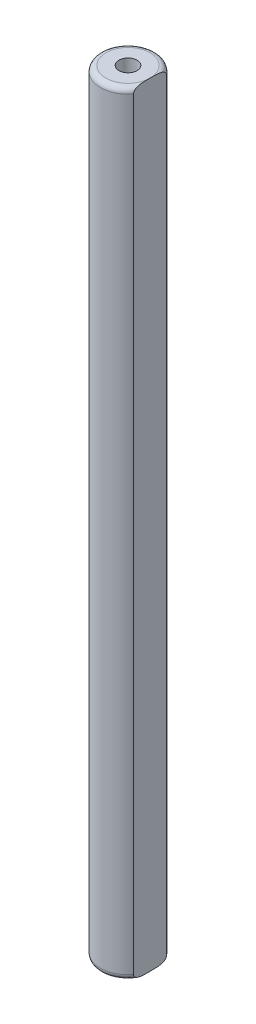
ISO-10303-21;
HEADER;
FILE_DESCRIPTION(('STEP AP214'),'2;1');
FILE_NAME('part.step','',(''),(''),'','','');
FILE_SCHEMA(('AUTOMOTIVE_DESIGN { 1 0 10303 214 1 1 1 1 }'));
ENDSEC;
DATA;
#1=APPLICATION_CONTEXT('core data for automotive mechanical design processes');
#2=APPLICATION_PROTOCOL_DEFINITION('international standard','automotive_design',2000,#1);
#3=PRODUCT_CONTEXT('',#1,'mechanical');
#4=PRODUCT('Part','Part','',(#3));
#5=PRODUCT_RELATED_PRODUCT_CATEGORY('part','',(#4));
#6=PRODUCT_DEFINITION_FORMATION('','',#4);
#7=PRODUCT_DEFINITION_CONTEXT('part definition',#1,'design');
#8=PRODUCT_DEFINITION('design','',#6,#7);
#9=PRODUCT_DEFINITION_SHAPE('','',#8);
#10=(LENGTH_UNIT() NAMED_UNIT(*) SI_UNIT(.MILLI.,.METRE.));
#11=(NAMED_UNIT(*) PLANE_ANGLE_UNIT() SI_UNIT($,.RADIAN.));
#12=(NAMED_UNIT(*) SI_UNIT($,.STERADIAN.) SOLID_ANGLE_UNIT());
#13=UNCERTAINTY_MEASURE_WITH_UNIT(LENGTH_MEASURE(1.E-05),#10,'distance_accuracy_value','');
#14=(GEOMETRIC_REPRESENTATION_CONTEXT(3) GLOBAL_UNCERTAINTY_ASSIGNED_CONTEXT((#13)) GLOBAL_UNIT_ASSIGNED_CONTEXT((#10,
#11,#12)) REPRESENTATION_CONTEXT('',''));
#15=CARTESIAN_POINT('',(0.,0.,0.));
#16=DIRECTION('',(0.,0.,1.));
#17=DIRECTION('',(1.,0.,0.));
#18=AXIS2_PLACEMENT_3D('',#15,#16,#17);
#19=CARTESIAN_POINT('',(0.,-35.15,0.));
#20=DIRECTION('',(0.,-1.,0.));
#21=DIRECTION('',(0.,0.,1.));
#22=AXIS2_PLACEMENT_3D('',#19,#20,#21);
#23=PLANE('',#22);
#24=CARTESIAN_POINT('',(0.,-35.15,0.));
#25=DIRECTION('',(0.,-1.,0.));
#26=DIRECTION('',(0.,0.,-1.));
#27=AXIS2_PLACEMENT_3D('',#24,#25,#26);
#28=CIRCLE('',#27,2.);
#29=CARTESIAN_POINT('',(2.,-35.15,0.));
#30=VERTEX_POINT('',#29);
#31=EDGE_CURVE('E11',#30,#30,#28,.T.);
#32=ORIENTED_EDGE('',*,*,#31,.T.);
#33=EDGE_LOOP('',(#32));
#34=FACE_BOUND('',#33,.T.);
#35=CARTESIAN_POINT('',(0.,-35.15,0.));
#36=DIRECTION('',(0.,1.,0.));
#37=DIRECTION('',(0.,0.,1.));
#38=AXIS2_PLACEMENT_3D('',#35,#36,#37);
#39=CIRCLE('',#38,0.825);
#40=CARTESIAN_POINT('',(0.,-35.15,0.825));
#41=VERTEX_POINT('',#40);
#42=EDGE_CURVE('E132',#41,#41,#39,.T.);
#43=ORIENTED_EDGE('',*,*,#42,.T.);
#44=EDGE_LOOP('',(#43));
#45=FACE_BOUND('',#44,.T.);
#46=ADVANCED_FACE('F32',(#34,#45),#23,.T.);
#47=CARTESIAN_POINT('',(0.,35.15,0.));
#48=DIRECTION('',(0.,-1.,0.));
#49=DIRECTION('',(0.,0.,-1.));
#50=AXIS2_PLACEMENT_3D('',#47,#48,#49);
#51=CYLINDRICAL_SURFACE('',#50,2.5);
#52=DIRECTION('',(0.,1.,0.));
#53=VECTOR('',#52,1.);
#54=CARTESIAN_POINT('',(2.,0.,-1.5));
#55=LINE('',#54,#53);
#56=CARTESIAN_POINT('',(2.,-34.65,-1.5));
#57=VERTEX_POINT('',#56);
#58=CARTESIAN_POINT('',(2.,34.65,-1.5));
#59=VERTEX_POINT('',#58);
#60=EDGE_CURVE('E79',#57,#59,#55,.T.);
#61=ORIENTED_EDGE('',*,*,#60,.F.);
#62=CARTESIAN_POINT('',(0.,-34.65,0.));
#63=DIRECTION('',(0.,-1.,0.));
#64=DIRECTION('',(0.,0.,-1.));
#65=AXIS2_PLACEMENT_3D('',#62,#63,#64);
#66=CIRCLE('',#65,2.5);
#67=CARTESIAN_POINT('',(2.,-34.65,1.5));
#68=VERTEX_POINT('',#67);
#69=EDGE_CURVE('E115',#57,#68,#66,.F.);
#70=ORIENTED_EDGE('',*,*,#69,.T.);
#71=DIRECTION('',(0.,1.,0.));
#72=VECTOR('',#71,1.);
#73=CARTESIAN_POINT('',(2.,0.,1.5));
#74=LINE('',#73,#72);
#75=CARTESIAN_POINT('',(2.,34.65,1.5));
#76=VERTEX_POINT('',#75);
#77=EDGE_CURVE('E120',#68,#76,#74,.T.);
#78=ORIENTED_EDGE('',*,*,#77,.T.);
#79=CARTESIAN_POINT('',(0.,34.65,0.));
#80=DIRECTION('',(0.,1.,0.));
#81=DIRECTION('',(0.,0.,1.));
#82=AXIS2_PLACEMENT_3D('',#79,#80,#81);
#83=CIRCLE('',#82,2.5);
#84=EDGE_CURVE('E74',#76,#59,#83,.F.);
#85=ORIENTED_EDGE('',*,*,#84,.T.);
#86=EDGE_LOOP('',(#61,#70,#78,#85));
#87=FACE_BOUND('',#86,.T.);
#88=ADVANCED_FACE('F151',(#87),#51,.T.);
#89=CARTESIAN_POINT('',(0.,35.15,0.));
#90=DIRECTION('',(0.,1.,0.));
#91=DIRECTION('',(0.,0.,1.));
#92=AXIS2_PLACEMENT_3D('',#89,#90,#91);
#93=PLANE('',#92);
#94=CARTESIAN_POINT('',(0.,35.15,0.));
#95=DIRECTION('',(0.,1.,0.));
#96=DIRECTION('',(0.,0.,1.));
#97=AXIS2_PLACEMENT_3D('',#94,#95,#96);
#98=CIRCLE('',#97,2.);
#99=CARTESIAN_POINT('',(2.,35.15,0.));
#100=VERTEX_POINT('',#99);
#101=EDGE_CURVE('E72',#100,#100,#98,.T.);
#102=ORIENTED_EDGE('',*,*,#101,.T.);
#103=EDGE_LOOP('',(#102));
#104=FACE_BOUND('',#103,.T.);
#105=CARTESIAN_POINT('',(0.,35.15,0.));
#106=DIRECTION('',(0.,1.,0.));
#107=DIRECTION('',(0.,0.,1.));
#108=AXIS2_PLACEMENT_3D('',#105,#106,#107);
#109=CIRCLE('',#108,0.825);
#110=CARTESIAN_POINT('',(0.,35.15,0.825));
#111=VERTEX_POINT('',#110);
#112=EDGE_CURVE('E87',#111,#111,#109,.T.);
#113=ORIENTED_EDGE('',*,*,#112,.F.);
#114=EDGE_LOOP('',(#113));
#115=FACE_BOUND('',#114,.T.);
#116=ADVANCED_FACE('F82',(#104,#115),#93,.T.);
#117=CARTESIAN_POINT('',(0.,30.15,0.));
#118=DIRECTION('',(0.,1.,0.));
#119=DIRECTION('',(0.,0.,1.));
#120=AXIS2_PLACEMENT_3D('',#117,#118,#119);
#121=CYLINDRICAL_SURFACE('',#120,0.825);
#122=CARTESIAN_POINT('',(0.,30.15,0.));
#123=DIRECTION('',(0.,1.,0.));
#124=DIRECTION('',(0.,0.,1.));
#125=AXIS2_PLACEMENT_3D('',#122,#123,#124);
#126=CIRCLE('',#125,0.825);
#127=CARTESIAN_POINT('',(0.,30.15,0.825));
#128=VERTEX_POINT('',#127);
#129=EDGE_CURVE('E84',#128,#128,#126,.T.);
#130=ORIENTED_EDGE('',*,*,#129,.F.);
#131=EDGE_LOOP('',(#130));
#132=FACE_BOUND('',#131,.T.);
#133=ORIENTED_EDGE('',*,*,#112,.T.);
#134=EDGE_LOOP('',(#133));
#135=FACE_BOUND('',#134,.T.);
#136=ADVANCED_FACE('F158',(#132,#135),#121,.F.);
#137=CARTESIAN_POINT('',(0.,30.15,0.));
#138=DIRECTION('',(0.,1.,0.));
#139=DIRECTION('',(0.,0.,1.));
#140=AXIS2_PLACEMENT_3D('',#137,#138,#139);
#141=PLANE('',#140);
#142=ORIENTED_EDGE('',*,*,#129,.T.);
#143=EDGE_LOOP('',(#142));
#144=FACE_BOUND('',#143,.T.);
#145=ADVANCED_FACE('F104',(#144),#141,.T.);
#146=CARTESIAN_POINT('',(2.,0.,-1.5));
#147=DIRECTION('',(-1.,0.,0.));
#148=DIRECTION('',(0.,0.,1.));
#149=AXIS2_PLACEMENT_3D('',#146,#147,#148);
#150=PLANE('',#149);
#151=ORIENTED_EDGE('',*,*,#77,.F.);
#152=CARTESIAN_POINT('',(2.,-34.65,1.5));
#153=CARTESIAN_POINT('',(2.,-34.6700065150284,1.50005508764519));
#154=CARTESIAN_POINT('',(2.,-34.6899505223803,1.49800297503596));
#155=CARTESIAN_POINT('',(2.,-34.7288908622129,1.49017103135305));
#156=CARTESIAN_POINT('',(2.,-34.747894786355,1.48442943896433));
#157=CARTESIAN_POINT('',(2.,-34.7845007170815,1.46971395516311));
#158=CARTESIAN_POINT('',(2.,-34.8021074472319,1.46075157527048));
#159=CARTESIAN_POINT('',(2.,-34.8357418270519,1.44018960181346));
#160=CARTESIAN_POINT('',(2.,-34.8517650844176,1.42858295243752));
#161=CARTESIAN_POINT('',(2.,-34.8889337995344,1.39760924057378));
#162=CARTESIAN_POINT('',(2.,-34.9091275913188,1.37710380043444));
#163=CARTESIAN_POINT('',(2.,-34.9460193785026,1.3332153788633));
#164=CARTESIAN_POINT('',(2.,-34.9627135559447,1.30982929844171));
#165=CARTESIAN_POINT('',(2.,-35.0025266059827,1.24588475655888));
#166=CARTESIAN_POINT('',(2.,-35.0231102761167,1.20375339504331));
#167=CARTESIAN_POINT('',(2.,-35.0492657628372,1.13857481760512));
#168=CARTESIAN_POINT('',(2.,-35.0572271665565,1.11639476146754));
#169=CARTESIAN_POINT('',(2.,-35.0717347834849,1.07158652733004));
#170=CARTESIAN_POINT('',(2.,-35.0782820228324,1.04895868735181));
#171=CARTESIAN_POINT('',(2.,-35.0954775535542,0.982989447767375));
#172=CARTESIAN_POINT('',(2.,-35.1045494991958,0.939240813702868));
#173=CARTESIAN_POINT('',(2.,-35.1194389319571,0.85118057519475));
#174=CARTESIAN_POINT('',(2.,-35.1252529100803,0.806868416119317));
#175=CARTESIAN_POINT('',(2.,-35.1345404183726,0.717748873858497));
#176=CARTESIAN_POINT('',(2.,-35.1380000262617,0.672940110398228));
#177=CARTESIAN_POINT('',(2.,-35.143276064899,0.583224127429996));
#178=CARTESIAN_POINT('',(2.,-35.1450920982067,0.53831688673903));
#179=CARTESIAN_POINT('',(2.,-35.1475884411658,0.45202717013826));
#180=CARTESIAN_POINT('',(2.,-35.148347176557,0.410646661478023));
#181=CARTESIAN_POINT('',(2.,-35.1493649293624,0.327877214900453));
#182=CARTESIAN_POINT('',(2.,-35.1496239046375,0.286488276566584));
#183=CARTESIAN_POINT('',(2.,-35.1499262759538,0.204245986253958));
#184=CARTESIAN_POINT('',(2.,-35.1499724201265,0.163392638975686));
#185=CARTESIAN_POINT('',(2.,-35.1499994454164,0.0816928216893292));
#186=CARTESIAN_POINT('',(2.,-35.1499803376138,0.0408463516913637));
#187=CARTESIAN_POINT('',(2.,-35.15,0.));
#188=B_SPLINE_CURVE_WITH_KNOTS('',3,(#152,#153,#154,#155,#156,#157,#158,#159,#160,#161,#162,
#163,#164,#165,#166,#167,#168,#169,#170,#171,#172,#173,#174,#175,#176,#177,#178,#179,#180,#181,
#182,#183,#184,#185,#186,#187),.UNSPECIFIED.,.F.,.F.,(4,2,2,2,2,2,2,2,2,2,2,2,2,2,2,2,2,4),(0.,
0.0598154823382477,0.119020807803606,0.178016596524454,0.237171689151979,0.323022405322567,
0.408966299732605,0.548800102010772,0.619474466309537,0.690097374684527,0.823948961414437,
0.957944437366601,1.09272554990601,1.22753924580541,1.35169671337948,1.47586464927862,
1.59842472260636,1.72096398530663),.UNSPECIFIED.);
#189=EDGE_CURVE('E41',#68,#30,#188,.T.);
#190=ORIENTED_EDGE('',*,*,#189,.T.);
#191=CARTESIAN_POINT('',(2.,-35.15,0.));
#192=CARTESIAN_POINT('',(2.,-35.149980484284,-0.0407626231076289));
#193=CARTESIAN_POINT('',(2.,-35.1499994433899,-0.0815253750922564));
#194=CARTESIAN_POINT('',(2.,-35.1499726519699,-0.163057529759021));
#195=CARTESIAN_POINT('',(2.,-35.1499268907924,-0.203826932431489));
#196=CARTESIAN_POINT('',(2.,-35.1496272394696,-0.285823216792328));
#197=CARTESIAN_POINT('',(2.,-35.1493710177251,-0.327050094241002));
#198=CARTESIAN_POINT('',(2.,-35.1483653267444,-0.409495794992682));
#199=CARTESIAN_POINT('',(2.,-35.1476158970779,-0.450714618676486));
#200=CARTESIAN_POINT('',(2.,-35.1452076449429,-0.534687159846425));
#201=CARTESIAN_POINT('',(2.,-35.1435155371863,-0.577440036322863));
#202=CARTESIAN_POINT('',(2.,-35.1386762279352,-0.662861842446352));
#203=CARTESIAN_POINT('',(2.,-35.1355293281928,-0.705530787660099));
#204=CARTESIAN_POINT('',(2.,-35.1271629448661,-0.790467964812873));
#205=CARTESIAN_POINT('',(2.,-35.1219534285849,-0.832737137282493));
#206=CARTESIAN_POINT('',(2.,-35.1087065375739,-0.916821134882455));
#207=CARTESIAN_POINT('',(2.,-35.1006717348777,-0.958636337716518));
#208=CARTESIAN_POINT('',(2.,-35.0868499282799,-1.01633423815903));
#209=CARTESIAN_POINT('',(2.,-35.0826447414506,-1.0325980627166));
#210=CARTESIAN_POINT('',(2.,-35.0735803939948,-1.06494846149724));
#211=CARTESIAN_POINT('',(2.,-35.0687209867408,-1.08103496638818));
#212=CARTESIAN_POINT('',(2.,-35.0530766101654,-1.12889043811801));
#213=CARTESIAN_POINT('',(2.,-35.0412104355907,-1.16032087149606));
#214=CARTESIAN_POINT('',(2.,-35.0138471087185,-1.22193787642586));
#215=CARTESIAN_POINT('',(2.,-34.9983172442343,-1.25211017751241));
#216=CARTESIAN_POINT('',(2.,-34.9629711649222,-1.30987180248264));
#217=CARTESIAN_POINT('',(2.,-34.9431618343013,-1.33746517402654));
#218=CARTESIAN_POINT('',(2.,-34.9063229296638,-1.37963467843693));
#219=CARTESIAN_POINT('',(2.,-34.890685118637,-1.39542133682361));
#220=CARTESIAN_POINT('',(2.,-34.8572261082969,-1.4245077100884));
#221=CARTESIAN_POINT('',(2.,-34.8394069701865,-1.43780974319198));
#222=CARTESIAN_POINT('',(2.,-34.8045634610992,-1.45935751669131));
#223=CARTESIAN_POINT('',(2.,-34.787825568107,-1.46806350146973));
#224=CARTESIAN_POINT('',(2.,-34.7531430315798,-1.48256312102217));
#225=CARTESIAN_POINT('',(2.,-34.7352009877708,-1.48836281472543));
#226=CARTESIAN_POINT('',(2.,-34.7059337018007,-1.49497096281988));
#227=CARTESIAN_POINT('',(2.,-34.6948421897842,-1.49684839330713));
#228=CARTESIAN_POINT('',(2.,-34.6725033908703,-1.49936626406293));
#229=CARTESIAN_POINT('',(2.,-34.6612558958349,-1.5000048503837));
#230=CARTESIAN_POINT('',(2.,-34.65,-1.5));
#231=B_SPLINE_CURVE_WITH_KNOTS('',3,(#191,#192,#193,#194,#195,#196,#197,#198,#199,#200,#201,
#202,#203,#204,#205,#206,#207,#208,#209,#210,#211,#212,#213,#214,#215,#216,#217,#218,#219,#220,
#221,#222,#223,#224,#225,#226,#227,#228,#229,#230),.UNSPECIFIED.,.F.,.F.,(4,2,2,2,2,2,2,2,2,2,2,
2,2,2,2,2,2,2,2,4),(0.,0.122288098502134,0.244596325308749,0.368278121933788,0.491949996900832,
0.620293921253729,0.74861123651507,0.876315899810972,1.00390460532892,1.05428854590096,
1.10469153363842,1.20529649885782,1.30683621704435,1.40821379274341,1.47468160162245,
1.54108708094666,1.5974625296124,1.65371995469663,1.68740390926937,1.72113823358774),.UNSPECIFIED.);
#232=EDGE_CURVE('E51',#30,#57,#231,.T.);
#233=ORIENTED_EDGE('',*,*,#232,.T.);
#234=ORIENTED_EDGE('',*,*,#60,.T.);
#235=CARTESIAN_POINT('',(2.,34.65,-1.5));
#236=CARTESIAN_POINT('',(2.,34.6700065150284,-1.50005508764519));
#237=CARTESIAN_POINT('',(2.,34.6899505223803,-1.49800297503596));
#238=CARTESIAN_POINT('',(2.,34.7288908622129,-1.49017103135305));
#239=CARTESIAN_POINT('',(2.,34.747894786355,-1.48442943896433));
#240=CARTESIAN_POINT('',(2.,34.7845007170815,-1.46971395516311));
#241=CARTESIAN_POINT('',(2.,34.8021074472319,-1.46075157527048));
#242=CARTESIAN_POINT('',(2.,34.8357418270519,-1.44018960181346));
#243=CARTESIAN_POINT('',(2.,34.8517650844176,-1.42858295243752));
#244=CARTESIAN_POINT('',(2.,34.8889337995344,-1.39760924057378));
#245=CARTESIAN_POINT('',(2.,34.9091275913188,-1.37710380043444));
#246=CARTESIAN_POINT('',(2.,34.9460193785026,-1.3332153788633));
#247=CARTESIAN_POINT('',(2.,34.9627135559447,-1.30982929844171));
#248=CARTESIAN_POINT('',(2.,35.0025266059827,-1.24588475655888));
#249=CARTESIAN_POINT('',(2.,35.0231102761167,-1.20375339504331));
#250=CARTESIAN_POINT('',(2.,35.0492657628372,-1.13857481760512));
#251=CARTESIAN_POINT('',(2.,35.0572271665565,-1.11639476146754));
#252=CARTESIAN_POINT('',(2.,35.0717347834849,-1.07158652733004));
#253=CARTESIAN_POINT('',(2.,35.0782820228324,-1.04895868735181));
#254=CARTESIAN_POINT('',(2.,35.0954775535542,-0.982989447767375));
#255=CARTESIAN_POINT('',(2.,35.1045494991958,-0.939240813702868));
#256=CARTESIAN_POINT('',(2.,35.1194389319571,-0.85118057519475));
#257=CARTESIAN_POINT('',(2.,35.1252529100803,-0.806868416119317));
#258=CARTESIAN_POINT('',(2.,35.1345404183726,-0.717748873858497));
#259=CARTESIAN_POINT('',(2.,35.1380000262617,-0.672940110398228));
#260=CARTESIAN_POINT('',(2.,35.143276064899,-0.583224127429996));
#261=CARTESIAN_POINT('',(2.,35.1450920982067,-0.53831688673903));
#262=CARTESIAN_POINT('',(2.,35.1475884411658,-0.45202717013826));
#263=CARTESIAN_POINT('',(2.,35.148347176557,-0.410646661478023));
#264=CARTESIAN_POINT('',(2.,35.1493649293624,-0.327877214900453));
#265=CARTESIAN_POINT('',(2.,35.1496239046375,-0.286488276566584));
#266=CARTESIAN_POINT('',(2.,35.1499262759538,-0.204245986253958));
#267=CARTESIAN_POINT('',(2.,35.1499724201265,-0.163392638975686));
#268=CARTESIAN_POINT('',(2.,35.1499994454164,-0.0816928216893292));
#269=CARTESIAN_POINT('',(2.,35.1499803376138,-0.0408463516913637));
#270=CARTESIAN_POINT('',(2.,35.15,0.));
#271=B_SPLINE_CURVE_WITH_KNOTS('',3,(#235,#236,#237,#238,#239,#240,#241,#242,#243,#244,#245,
#246,#247,#248,#249,#250,#251,#252,#253,#254,#255,#256,#257,#258,#259,#260,#261,#262,#263,#264,
#265,#266,#267,#268,#269,#270),.UNSPECIFIED.,.F.,.F.,(4,2,2,2,2,2,2,2,2,2,2,2,2,2,2,2,2,4),(0.,
0.0598154823382477,0.119020807803606,0.178016596524454,0.237171689151979,0.323022405322567,
0.408966299732605,0.548800102010772,0.619474466309537,0.690097374684527,0.823948961414437,
0.957944437366601,1.09272554990601,1.22753924580541,1.35169671337948,1.47586464927862,
1.59842472260636,1.72096398530663),.UNSPECIFIED.);
#272=EDGE_CURVE('E76',#59,#100,#271,.T.);
#273=ORIENTED_EDGE('',*,*,#272,.T.);
#274=CARTESIAN_POINT('',(2.,35.15,0.));
#275=CARTESIAN_POINT('',(2.,35.149980484284,0.0407626231076289));
#276=CARTESIAN_POINT('',(2.,35.1499994433899,0.0815253750922564));
#277=CARTESIAN_POINT('',(2.,35.1499726519699,0.163057529759021));
#278=CARTESIAN_POINT('',(2.,35.1499268907924,0.203826932431489));
#279=CARTESIAN_POINT('',(2.,35.1496272394696,0.285823216792328));
#280=CARTESIAN_POINT('',(2.,35.1493710177251,0.327050094241002));
#281=CARTESIAN_POINT('',(2.,35.1483653267444,0.409495794992682));
#282=CARTESIAN_POINT('',(2.,35.1476158970779,0.450714618676486));
#283=CARTESIAN_POINT('',(2.,35.1452076449429,0.534687159846425));
#284=CARTESIAN_POINT('',(2.,35.1435155371863,0.577440036322863));
#285=CARTESIAN_POINT('',(2.,35.1386762279352,0.662861842446352));
#286=CARTESIAN_POINT('',(2.,35.1355293281928,0.705530787660099));
#287=CARTESIAN_POINT('',(2.,35.1271629448661,0.790467964812873));
#288=CARTESIAN_POINT('',(2.,35.1219534285849,0.832737137282493));
#289=CARTESIAN_POINT('',(2.,35.1087065375739,0.916821134882455));
#290=CARTESIAN_POINT('',(2.,35.1006717348777,0.958636337716518));
#291=CARTESIAN_POINT('',(2.,35.0868499282799,1.01633423815903));
#292=CARTESIAN_POINT('',(2.,35.0826447414506,1.0325980627166));
#293=CARTESIAN_POINT('',(2.,35.0735803939948,1.06494846149724));
#294=CARTESIAN_POINT('',(2.,35.0687209867408,1.08103496638818));
#295=CARTESIAN_POINT('',(2.,35.0530766101654,1.12889043811801));
#296=CARTESIAN_POINT('',(2.,35.0412104355907,1.16032087149606));
#297=CARTESIAN_POINT('',(2.,35.0138471087185,1.22193787642586));
#298=CARTESIAN_POINT('',(2.,34.9983172442343,1.25211017751241));
#299=CARTESIAN_POINT('',(2.,34.9629711649222,1.30987180248264));
#300=CARTESIAN_POINT('',(2.,34.9431618343013,1.33746517402654));
#301=CARTESIAN_POINT('',(2.,34.9063229296638,1.37963467843693));
#302=CARTESIAN_POINT('',(2.,34.890685118637,1.39542133682361));
#303=CARTESIAN_POINT('',(2.,34.8572261082969,1.4245077100884));
#304=CARTESIAN_POINT('',(2.,34.8394069701865,1.43780974319198));
#305=CARTESIAN_POINT('',(2.,34.8045634610992,1.45935751669131));
#306=CARTESIAN_POINT('',(2.,34.787825568107,1.46806350146973));
#307=CARTESIAN_POINT('',(2.,34.7531430315798,1.48256312102217));
#308=CARTESIAN_POINT('',(2.,34.7352009877708,1.48836281472543));
#309=CARTESIAN_POINT('',(2.,34.7059337018007,1.49497096281988));
#310=CARTESIAN_POINT('',(2.,34.6948421897842,1.49684839330713));
#311=CARTESIAN_POINT('',(2.,34.6725033908703,1.49936626406293));
#312=CARTESIAN_POINT('',(2.,34.6612558958349,1.5000048503837));
#313=CARTESIAN_POINT('',(2.,34.65,1.5));
#314=B_SPLINE_CURVE_WITH_KNOTS('',3,(#274,#275,#276,#277,#278,#279,#280,#281,#282,#283,#284,
#285,#286,#287,#288,#289,#290,#291,#292,#293,#294,#295,#296,#297,#298,#299,#300,#301,#302,#303,
#304,#305,#306,#307,#308,#309,#310,#311,#312,#313),.UNSPECIFIED.,.F.,.F.,(4,2,2,2,2,2,2,2,2,2,2,
2,2,2,2,2,2,2,2,4),(0.,0.122288098502134,0.244596325308749,0.368278121933788,0.491949996900832,
0.620293921253729,0.74861123651507,0.876315899810972,1.00390460532892,1.05428854590096,
1.10469153363842,1.20529649885782,1.30683621704435,1.40821379274341,1.47468160162245,
1.54108708094666,1.5974625296124,1.65371995469663,1.68740390926937,1.72113823358774),.UNSPECIFIED.);
#315=EDGE_CURVE('E67',#100,#76,#314,.T.);
#316=ORIENTED_EDGE('',*,*,#315,.T.);
#317=EDGE_LOOP('',(#151,#190,#233,#234,#273,#316));
#318=FACE_BOUND('',#317,.T.);
#319=ADVANCED_FACE('F78',(#318),#150,.F.);
#320=CARTESIAN_POINT('',(0.,34.65,0.));
#321=DIRECTION('',(0.,1.,0.));
#322=DIRECTION('',(0.,0.,1.));
#323=AXIS2_PLACEMENT_3D('',#320,#321,#322);
#324=TOROIDAL_SURFACE('',#323,2.,0.5);
#325=ORIENTED_EDGE('',*,*,#272,.F.);
#326=ORIENTED_EDGE('',*,*,#84,.F.);
#327=ORIENTED_EDGE('',*,*,#315,.F.);
#328=ORIENTED_EDGE('',*,*,#101,.F.);
#329=EDGE_LOOP('',(#325,#326,#327,#328));
#330=FACE_BOUND('',#329,.T.);
#331=ADVANCED_FACE('F70',(#330),#324,.T.);
#332=CARTESIAN_POINT('',(0.,-30.15,0.));
#333=DIRECTION('',(0.,-1.,0.));
#334=DIRECTION('',(0.,0.,-1.));
#335=AXIS2_PLACEMENT_3D('',#332,#333,#334);
#336=CYLINDRICAL_SURFACE('',#335,0.825);
#337=CARTESIAN_POINT('',(0.,-30.15,0.));
#338=DIRECTION('',(0.,1.,0.));
#339=DIRECTION('',(0.,0.,1.));
#340=AXIS2_PLACEMENT_3D('',#337,#338,#339);
#341=CIRCLE('',#340,0.825);
#342=CARTESIAN_POINT('',(0.,-30.15,0.825));
#343=VERTEX_POINT('',#342);
#344=EDGE_CURVE('E130',#343,#343,#341,.T.);
#345=ORIENTED_EDGE('',*,*,#344,.T.);
#346=EDGE_LOOP('',(#345));
#347=FACE_BOUND('',#346,.T.);
#348=ORIENTED_EDGE('',*,*,#42,.F.);
#349=EDGE_LOOP('',(#348));
#350=FACE_BOUND('',#349,.T.);
#351=ADVANCED_FACE('F141',(#347,#350),#336,.F.);
#352=CARTESIAN_POINT('',(0.,-30.15,0.));
#353=DIRECTION('',(0.,-1.,0.));
#354=DIRECTION('',(0.,0.,1.));
#355=AXIS2_PLACEMENT_3D('',#352,#353,#354);
#356=PLANE('',#355);
#357=ORIENTED_EDGE('',*,*,#344,.F.);
#358=EDGE_LOOP('',(#357));
#359=FACE_BOUND('',#358,.T.);
#360=ADVANCED_FACE('F143',(#359),#356,.T.);
#361=CARTESIAN_POINT('',(0.,-34.65,0.));
#362=DIRECTION('',(0.,-1.,0.));
#363=DIRECTION('',(0.,0.,-1.));
#364=AXIS2_PLACEMENT_3D('',#361,#362,#363);
#365=TOROIDAL_SURFACE('',#364,2.,0.5);
#366=ORIENTED_EDGE('',*,*,#232,.F.);
#367=ORIENTED_EDGE('',*,*,#31,.F.);
#368=ORIENTED_EDGE('',*,*,#189,.F.);
#369=ORIENTED_EDGE('',*,*,#69,.F.);
#370=EDGE_LOOP('',(#366,#367,#368,#369));
#371=FACE_BOUND('',#370,.T.);
#372=ADVANCED_FACE('F34',(#371),#365,.T.);
#373=CLOSED_SHELL('',(#46,#88,#116,#136,#145,#319,#331,#351,#360,#372));
#374=MANIFOLD_SOLID_BREP('B2',#373);
#375=ADVANCED_BREP_SHAPE_REPRESENTATION('',(#18,#374),#14);
#376=SHAPE_DEFINITION_REPRESENTATION(#9,#375);
ENDSEC;
END-ISO-10303-21;
